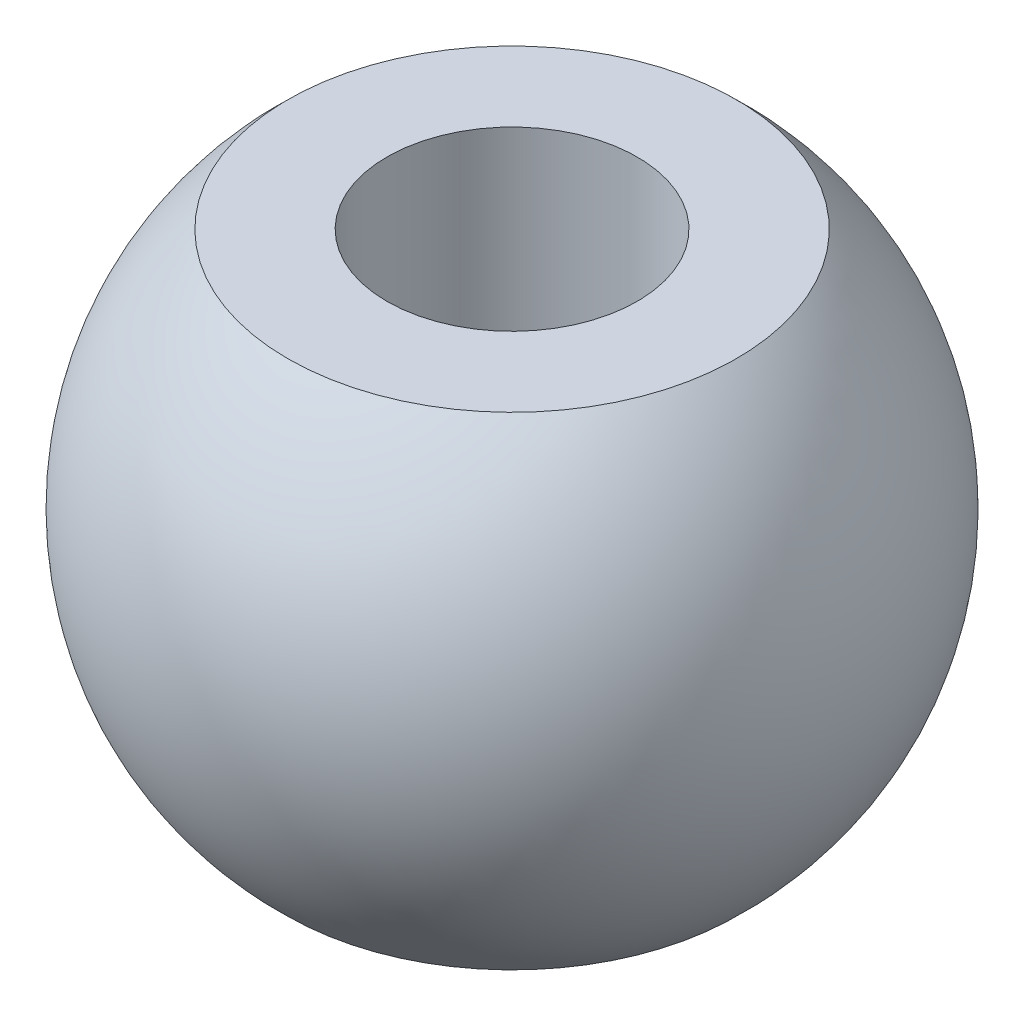
ISO-10303-21;
HEADER;
FILE_DESCRIPTION(('STEP AP214'),'2;1');
FILE_NAME('part.step','',(''),(''),'','','');
FILE_SCHEMA(('AUTOMOTIVE_DESIGN { 1 0 10303 214 1 1 1 1 }'));
ENDSEC;
DATA;
#1=APPLICATION_CONTEXT('core data for automotive mechanical design processes');
#2=APPLICATION_PROTOCOL_DEFINITION('international standard','automotive_design',2000,#1);
#3=PRODUCT_CONTEXT('',#1,'mechanical');
#4=PRODUCT('Part','Part','',(#3));
#5=PRODUCT_RELATED_PRODUCT_CATEGORY('part','',(#4));
#6=PRODUCT_DEFINITION_FORMATION('','',#4);
#7=PRODUCT_DEFINITION_CONTEXT('part definition',#1,'design');
#8=PRODUCT_DEFINITION('design','',#6,#7);
#9=PRODUCT_DEFINITION_SHAPE('','',#8);
#10=(LENGTH_UNIT() NAMED_UNIT(*) SI_UNIT(.MILLI.,.METRE.));
#11=(NAMED_UNIT(*) PLANE_ANGLE_UNIT() SI_UNIT($,.RADIAN.));
#12=(NAMED_UNIT(*) SI_UNIT($,.STERADIAN.) SOLID_ANGLE_UNIT());
#13=UNCERTAINTY_MEASURE_WITH_UNIT(LENGTH_MEASURE(1.E-05),#10,'distance_accuracy_value','');
#14=(GEOMETRIC_REPRESENTATION_CONTEXT(3) GLOBAL_UNCERTAINTY_ASSIGNED_CONTEXT((#13)) GLOBAL_UNIT_ASSIGNED_CONTEXT((#10,
#11,#12)) REPRESENTATION_CONTEXT('',''));
#15=CARTESIAN_POINT('',(0.,0.,0.));
#16=DIRECTION('',(0.,0.,1.));
#17=DIRECTION('',(1.,0.,0.));
#18=AXIS2_PLACEMENT_3D('',#15,#16,#17);
#19=CARTESIAN_POINT('',(0.,0.,0.));
#20=DIRECTION('',(0.,0.,-1.));
#21=DIRECTION('',(1.,0.,0.));
#22=AXIS2_PLACEMENT_3D('',#19,#20,#21);
#23=SPHERICAL_SURFACE('',#22,4.675);
#24=CARTESIAN_POINT('',(0.,0.,0.));
#25=DIRECTION('',(0.,1.,0.));
#26=DIRECTION('',(0.,0.,1.));
#27=AXIS2_PLACEMENT_3D('',#24,#25,#26);
#28=SPHERICAL_SURFACE('',#27,4.675);
#29=CARTESIAN_POINT('',(0.,3.425,0.));
#30=DIRECTION('',(0.,1.,0.));
#31=DIRECTION('',(0.,0.,1.));
#32=AXIS2_PLACEMENT_3D('',#29,#30,#31);
#33=CIRCLE('',#32,3.18198051533946);
#34=CARTESIAN_POINT('',(0.,3.425,3.18198051533946));
#35=VERTEX_POINT('',#34);
#36=EDGE_CURVE('E10',#35,#35,#33,.T.);
#37=ORIENTED_EDGE('',*,*,#36,.F.);
#38=EDGE_LOOP('',(#37));
#39=FACE_BOUND('',#38,.T.);
#40=CARTESIAN_POINT('',(0.,-3.425,0.));
#41=DIRECTION('',(0.,-1.,0.));
#42=DIRECTION('',(0.,0.,-1.));
#43=AXIS2_PLACEMENT_3D('',#40,#41,#42);
#44=CIRCLE('',#43,3.18198051533946);
#45=CARTESIAN_POINT('',(0.,-3.425,-3.18198051533946));
#46=VERTEX_POINT('',#45);
#47=EDGE_CURVE('E33',#46,#46,#44,.T.);
#48=ORIENTED_EDGE('',*,*,#47,.F.);
#49=EDGE_LOOP('',(#48));
#50=FACE_BOUND('',#49,.T.);
#51=ADVANCED_FACE('F30',(#39,#50),#28,.T.);
#52=CARTESIAN_POINT('',(0.,3.425,0.));
#53=DIRECTION('',(0.,1.,0.));
#54=DIRECTION('',(0.,0.,1.));
#55=AXIS2_PLACEMENT_3D('',#52,#53,#54);
#56=PLANE('',#55);
#57=CARTESIAN_POINT('',(0.,3.425,0.));
#58=DIRECTION('',(0.,1.,0.));
#59=DIRECTION('',(0.,0.,1.));
#60=AXIS2_PLACEMENT_3D('',#57,#58,#59);
#61=CIRCLE('',#60,1.775);
#62=CARTESIAN_POINT('',(0.,3.425,1.775));
#63=VERTEX_POINT('',#62);
#64=EDGE_CURVE('E42',#63,#63,#61,.T.);
#65=ORIENTED_EDGE('',*,*,#64,.F.);
#66=EDGE_LOOP('',(#65));
#67=FACE_BOUND('',#66,.T.);
#68=ORIENTED_EDGE('',*,*,#36,.T.);
#69=EDGE_LOOP('',(#68));
#70=FACE_BOUND('',#69,.T.);
#71=ADVANCED_FACE('F57',(#67,#70),#56,.T.);
#72=CARTESIAN_POINT('',(0.,-3.425,0.));
#73=DIRECTION('',(0.,-1.,0.));
#74=DIRECTION('',(0.,0.,1.));
#75=AXIS2_PLACEMENT_3D('',#72,#73,#74);
#76=PLANE('',#75);
#77=CARTESIAN_POINT('',(0.,-3.425,0.));
#78=DIRECTION('',(0.,1.,0.));
#79=DIRECTION('',(0.,0.,1.));
#80=AXIS2_PLACEMENT_3D('',#77,#78,#79);
#81=CIRCLE('',#80,1.775);
#82=CARTESIAN_POINT('',(0.,-3.425,1.775));
#83=VERTEX_POINT('',#82);
#84=EDGE_CURVE('E40',#83,#83,#81,.T.);
#85=ORIENTED_EDGE('',*,*,#84,.T.);
#86=EDGE_LOOP('',(#85));
#87=FACE_BOUND('',#86,.T.);
#88=ORIENTED_EDGE('',*,*,#47,.T.);
#89=EDGE_LOOP('',(#88));
#90=FACE_BOUND('',#89,.T.);
#91=ADVANCED_FACE('F48',(#87,#90),#76,.T.);
#92=CARTESIAN_POINT('',(0.,-3.425,0.));
#93=DIRECTION('',(0.,1.,0.));
#94=DIRECTION('',(0.,0.,1.));
#95=AXIS2_PLACEMENT_3D('',#92,#93,#94);
#96=CYLINDRICAL_SURFACE('',#95,1.775);
#97=ORIENTED_EDGE('',*,*,#84,.F.);
#98=EDGE_LOOP('',(#97));
#99=FACE_BOUND('',#98,.T.);
#100=ORIENTED_EDGE('',*,*,#64,.T.);
#101=EDGE_LOOP('',(#100));
#102=FACE_BOUND('',#101,.T.);
#103=ADVANCED_FACE('F51',(#99,#102),#96,.F.);
#104=CLOSED_SHELL('',(#51,#71,#91,#103));
#105=MANIFOLD_SOLID_BREP('B2',#104);
#106=ADVANCED_BREP_SHAPE_REPRESENTATION('',(#18,#105),#14);
#107=SHAPE_DEFINITION_REPRESENTATION(#9,#106);
ENDSEC;
END-ISO-10303-21;
